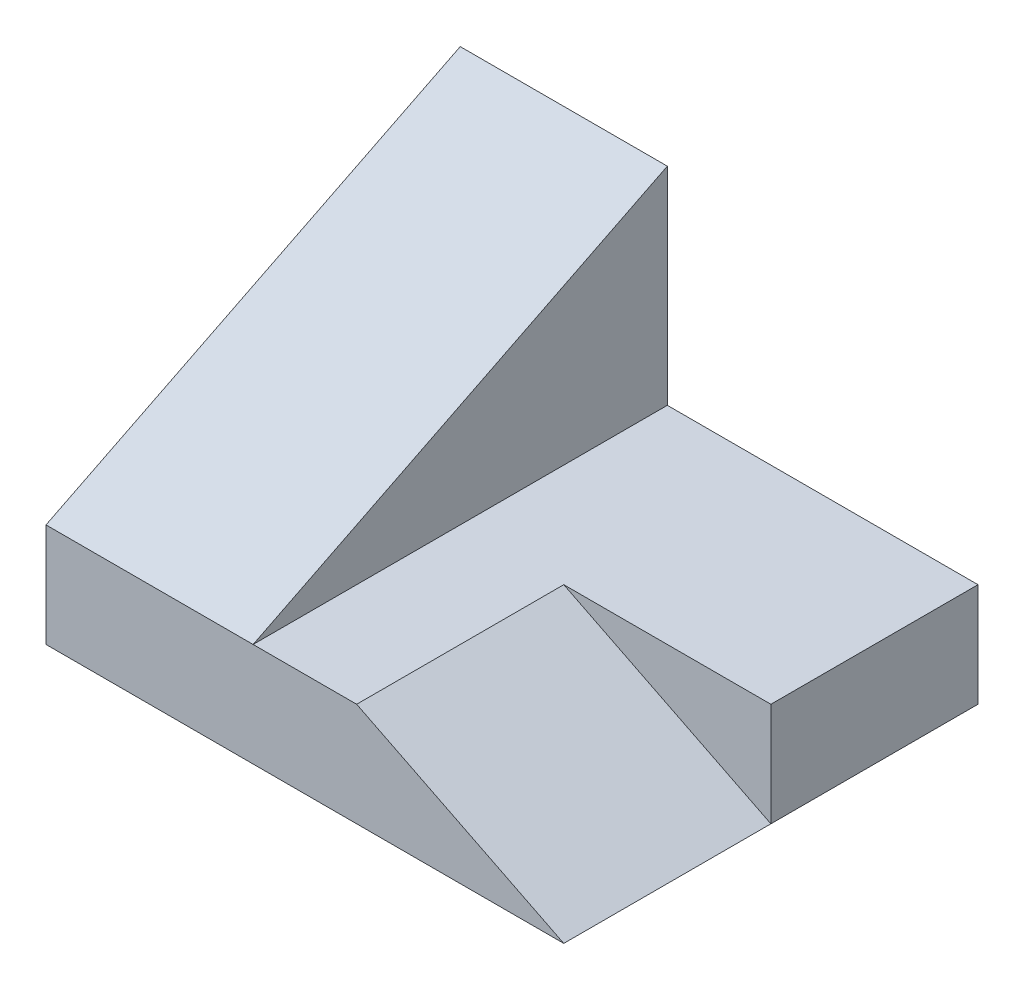
ISO-10303-21;
HEADER;
FILE_DESCRIPTION(('STEP AP214'),'2;1');
FILE_NAME('part.step','',(''),(''),'','','');
FILE_SCHEMA(('AUTOMOTIVE_DESIGN { 1 0 10303 214 1 1 1 1 }'));
ENDSEC;
DATA;
#1=APPLICATION_CONTEXT('core data for automotive mechanical design processes');
#2=APPLICATION_PROTOCOL_DEFINITION('international standard','automotive_design',2000,#1);
#3=PRODUCT_CONTEXT('',#1,'mechanical');
#4=PRODUCT('Part','Part','',(#3));
#5=PRODUCT_RELATED_PRODUCT_CATEGORY('part','',(#4));
#6=PRODUCT_DEFINITION_FORMATION('','',#4);
#7=PRODUCT_DEFINITION_CONTEXT('part definition',#1,'design');
#8=PRODUCT_DEFINITION('design','',#6,#7);
#9=PRODUCT_DEFINITION_SHAPE('','',#8);
#10=(LENGTH_UNIT() NAMED_UNIT(*) SI_UNIT(.MILLI.,.METRE.));
#11=(NAMED_UNIT(*) PLANE_ANGLE_UNIT() SI_UNIT($,.RADIAN.));
#12=(NAMED_UNIT(*) SI_UNIT($,.STERADIAN.) SOLID_ANGLE_UNIT());
#13=UNCERTAINTY_MEASURE_WITH_UNIT(LENGTH_MEASURE(1.E-05),#10,'distance_accuracy_value','');
#14=(GEOMETRIC_REPRESENTATION_CONTEXT(3) GLOBAL_UNCERTAINTY_ASSIGNED_CONTEXT((#13)) GLOBAL_UNIT_ASSIGNED_CONTEXT((#10,
#11,#12)) REPRESENTATION_CONTEXT('',''));
#15=CARTESIAN_POINT('',(0.,0.,0.));
#16=DIRECTION('',(0.,0.,1.));
#17=DIRECTION('',(1.,0.,0.));
#18=AXIS2_PLACEMENT_3D('',#15,#16,#17);
#19=CARTESIAN_POINT('',(63.5,25.4,101.6));
#20=DIRECTION('',(-1.,0.,0.));
#21=DIRECTION('',(0.,0.,1.));
#22=AXIS2_PLACEMENT_3D('',#19,#20,#21);
#23=PLANE('',#22);
#24=DIRECTION('',(0.,1.,0.));
#25=VECTOR('',#24,1.);
#26=CARTESIAN_POINT('',(63.5,0.,50.8));
#27=LINE('',#26,#25);
#28=CARTESIAN_POINT('',(63.5,0.,50.8));
#29=VERTEX_POINT('',#28);
#30=CARTESIAN_POINT('',(63.5,25.4,50.8));
#31=VERTEX_POINT('',#30);
#32=EDGE_CURVE('E96',#29,#31,#27,.T.);
#33=ORIENTED_EDGE('',*,*,#32,.F.);
#34=DIRECTION('',(0.,0.,-1.));
#35=VECTOR('',#34,1.);
#36=CARTESIAN_POINT('',(63.5,0.,101.6));
#37=LINE('',#36,#35);
#38=CARTESIAN_POINT('',(63.5,0.,0.));
#39=VERTEX_POINT('',#38);
#40=EDGE_CURVE('E146',#29,#39,#37,.T.);
#41=ORIENTED_EDGE('',*,*,#40,.T.);
#42=DIRECTION('',(0.,1.,0.));
#43=VECTOR('',#42,1.);
#44=CARTESIAN_POINT('',(63.5,25.4,0.));
#45=LINE('',#44,#43);
#46=CARTESIAN_POINT('',(63.5,25.4,0.));
#47=VERTEX_POINT('',#46);
#48=EDGE_CURVE('E134',#39,#47,#45,.T.);
#49=ORIENTED_EDGE('',*,*,#48,.T.);
#50=DIRECTION('',(0.,0.,-1.));
#51=VECTOR('',#50,1.);
#52=CARTESIAN_POINT('',(63.5,25.4,101.6));
#53=LINE('',#52,#51);
#54=EDGE_CURVE('E145',#31,#47,#53,.T.);
#55=ORIENTED_EDGE('',*,*,#54,.F.);
#56=EDGE_LOOP('',(#33,#41,#49,#55));
#57=FACE_BOUND('',#56,.T.);
#58=ADVANCED_FACE('F33',(#57),#23,.F.);
#59=CARTESIAN_POINT('',(-63.5,0.,101.6));
#60=DIRECTION('',(1.,0.,0.));
#61=DIRECTION('',(0.,1.,0.));
#62=AXIS2_PLACEMENT_3D('',#59,#60,#61);
#63=PLANE('',#62);
#64=DIRECTION('',(0.,-1.,0.));
#65=VECTOR('',#64,1.);
#66=CARTESIAN_POINT('',(-63.5,0.,101.6));
#67=LINE('',#66,#65);
#68=CARTESIAN_POINT('',(-63.5,25.4,101.6));
#69=VERTEX_POINT('',#68);
#70=CARTESIAN_POINT('',(-63.5,0.,101.6));
#71=VERTEX_POINT('',#70);
#72=EDGE_CURVE('E121',#69,#71,#67,.T.);
#73=ORIENTED_EDGE('',*,*,#72,.F.);
#74=DIRECTION('',(0.,0.447213595499958,-0.894427190999916));
#75=VECTOR('',#74,1.);
#76=CARTESIAN_POINT('',(-63.5,20.32,111.76));
#77=LINE('',#76,#75);
#78=CARTESIAN_POINT('',(-63.5,76.2,0.));
#79=VERTEX_POINT('',#78);
#80=EDGE_CURVE('E117',#69,#79,#77,.T.);
#81=ORIENTED_EDGE('',*,*,#80,.T.);
#82=DIRECTION('',(0.,-1.,0.));
#83=VECTOR('',#82,1.);
#84=CARTESIAN_POINT('',(-63.5,0.,0.));
#85=LINE('',#84,#83);
#86=CARTESIAN_POINT('',(-63.5,0.,0.));
#87=VERTEX_POINT('',#86);
#88=EDGE_CURVE('E120',#79,#87,#85,.T.);
#89=ORIENTED_EDGE('',*,*,#88,.T.);
#90=DIRECTION('',(0.,0.,-1.));
#91=VECTOR('',#90,1.);
#92=CARTESIAN_POINT('',(-63.5,0.,101.6));
#93=LINE('',#92,#91);
#94=EDGE_CURVE('E11',#71,#87,#93,.T.);
#95=ORIENTED_EDGE('',*,*,#94,.F.);
#96=EDGE_LOOP('',(#73,#81,#89,#95));
#97=FACE_BOUND('',#96,.T.);
#98=ADVANCED_FACE('F35',(#97),#63,.F.);
#99=CARTESIAN_POINT('',(63.5,0.,101.6));
#100=DIRECTION('',(0.,1.,0.));
#101=DIRECTION('',(0.,0.,1.));
#102=AXIS2_PLACEMENT_3D('',#99,#100,#101);
#103=PLANE('',#102);
#104=DIRECTION('',(1.,0.,0.));
#105=VECTOR('',#104,1.);
#106=CARTESIAN_POINT('',(63.5,0.,0.));
#107=LINE('',#106,#105);
#108=EDGE_CURVE('E131',#87,#39,#107,.T.);
#109=ORIENTED_EDGE('',*,*,#108,.T.);
#110=ORIENTED_EDGE('',*,*,#40,.F.);
#111=CARTESIAN_POINT('',(63.5,0.,101.6));
#112=VERTEX_POINT('',#111);
#113=EDGE_CURVE('E41',#112,#29,#37,.T.);
#114=ORIENTED_EDGE('',*,*,#113,.F.);
#115=DIRECTION('',(1.,0.,0.));
#116=VECTOR('',#115,1.);
#117=CARTESIAN_POINT('',(63.5,0.,101.6));
#118=LINE('',#117,#116);
#119=EDGE_CURVE('E123',#71,#112,#118,.T.);
#120=ORIENTED_EDGE('',*,*,#119,.F.);
#121=ORIENTED_EDGE('',*,*,#94,.T.);
#122=EDGE_LOOP('',(#109,#110,#114,#120,#121));
#123=FACE_BOUND('',#122,.T.);
#124=ADVANCED_FACE('F152',(#123),#103,.F.);
#125=CARTESIAN_POINT('',(-12.7,25.4,101.6));
#126=DIRECTION('',(0.,-1.,0.));
#127=DIRECTION('',(0.,0.,-1.));
#128=AXIS2_PLACEMENT_3D('',#125,#126,#127);
#129=PLANE('',#128);
#130=DIRECTION('',(-1.,0.,0.));
#131=VECTOR('',#130,1.);
#132=CARTESIAN_POINT('',(-12.7,25.4,101.6));
#133=LINE('',#132,#131);
#134=CARTESIAN_POINT('',(12.7,25.4,101.6));
#135=VERTEX_POINT('',#134);
#136=CARTESIAN_POINT('',(-12.7,25.4,101.6));
#137=VERTEX_POINT('',#136);
#138=EDGE_CURVE('E108',#135,#137,#133,.T.);
#139=ORIENTED_EDGE('',*,*,#138,.F.);
#140=DIRECTION('',(0.,0.,1.));
#141=VECTOR('',#140,1.);
#142=CARTESIAN_POINT('',(12.7,25.4,50.8));
#143=LINE('',#142,#141);
#144=CARTESIAN_POINT('',(12.7,25.4,50.8));
#145=VERTEX_POINT('',#144);
#146=EDGE_CURVE('E48',#145,#135,#143,.T.);
#147=ORIENTED_EDGE('',*,*,#146,.F.);
#148=DIRECTION('',(-1.,0.,0.));
#149=VECTOR('',#148,1.);
#150=CARTESIAN_POINT('',(0.,25.4,50.8));
#151=LINE('',#150,#149);
#152=EDGE_CURVE('E97',#31,#145,#151,.T.);
#153=ORIENTED_EDGE('',*,*,#152,.F.);
#154=ORIENTED_EDGE('',*,*,#54,.T.);
#155=DIRECTION('',(-1.,0.,0.));
#156=VECTOR('',#155,1.);
#157=CARTESIAN_POINT('',(-12.7,25.4,0.));
#158=LINE('',#157,#156);
#159=CARTESIAN_POINT('',(-12.7,25.4,0.));
#160=VERTEX_POINT('',#159);
#161=EDGE_CURVE('E137',#47,#160,#158,.T.);
#162=ORIENTED_EDGE('',*,*,#161,.T.);
#163=DIRECTION('',(0.,0.,-1.));
#164=VECTOR('',#163,1.);
#165=CARTESIAN_POINT('',(-12.7,25.4,101.6));
#166=LINE('',#165,#164);
#167=EDGE_CURVE('E128',#137,#160,#166,.T.);
#168=ORIENTED_EDGE('',*,*,#167,.F.);
#169=EDGE_LOOP('',(#139,#147,#153,#154,#162,#168));
#170=FACE_BOUND('',#169,.T.);
#171=ADVANCED_FACE('F106',(#170),#129,.F.);
#172=CARTESIAN_POINT('',(-12.7,76.2,101.6));
#173=DIRECTION('',(-1.,0.,0.));
#174=DIRECTION('',(0.,-1.,0.));
#175=AXIS2_PLACEMENT_3D('',#172,#173,#174);
#176=PLANE('',#175);
#177=DIRECTION('',(0.,1.,0.));
#178=VECTOR('',#177,1.);
#179=CARTESIAN_POINT('',(-12.7,76.2,0.));
#180=LINE('',#179,#178);
#181=CARTESIAN_POINT('',(-12.7,76.2,0.));
#182=VERTEX_POINT('',#181);
#183=EDGE_CURVE('E139',#160,#182,#180,.T.);
#184=ORIENTED_EDGE('',*,*,#183,.T.);
#185=DIRECTION('',(0.,-0.447213595499958,0.894427190999916));
#186=VECTOR('',#185,1.);
#187=CARTESIAN_POINT('',(-12.7,35.56,81.28));
#188=LINE('',#187,#186);
#189=EDGE_CURVE('E110',#182,#137,#188,.T.);
#190=ORIENTED_EDGE('',*,*,#189,.T.);
#191=ORIENTED_EDGE('',*,*,#167,.T.);
#192=EDGE_LOOP('',(#184,#190,#191));
#193=FACE_BOUND('',#192,.T.);
#194=ADVANCED_FACE('F160',(#193),#176,.F.);
#195=CARTESIAN_POINT('',(0.,0.,101.6));
#196=DIRECTION('',(0.,0.,-1.));
#197=DIRECTION('',(-1.,0.,0.));
#198=AXIS2_PLACEMENT_3D('',#195,#196,#197);
#199=PLANE('',#198);
#200=ORIENTED_EDGE('',*,*,#119,.T.);
#201=DIRECTION('',(0.894427190999916,-0.447213595499958,0.));
#202=VECTOR('',#201,1.);
#203=CARTESIAN_POINT('',(12.7,25.4,101.6));
#204=LINE('',#203,#202);
#205=EDGE_CURVE('E103',#135,#112,#204,.T.);
#206=ORIENTED_EDGE('',*,*,#205,.F.);
#207=ORIENTED_EDGE('',*,*,#138,.T.);
#208=DIRECTION('',(-1.,0.,0.));
#209=VECTOR('',#208,1.);
#210=CARTESIAN_POINT('',(275.306403026729,25.4000000000001,101.6));
#211=LINE('',#210,#209);
#212=EDGE_CURVE('E56',#137,#69,#211,.T.);
#213=ORIENTED_EDGE('',*,*,#212,.T.);
#214=ORIENTED_EDGE('',*,*,#72,.T.);
#215=EDGE_LOOP('',(#200,#206,#207,#213,#214));
#216=FACE_BOUND('',#215,.T.);
#217=ADVANCED_FACE('F166',(#216),#199,.F.);
#218=CARTESIAN_POINT('',(0.,0.,0.));
#219=DIRECTION('',(0.,0.,-1.));
#220=DIRECTION('',(-1.,0.,0.));
#221=AXIS2_PLACEMENT_3D('',#218,#219,#220);
#222=PLANE('',#221);
#223=ORIENTED_EDGE('',*,*,#88,.F.);
#224=DIRECTION('',(-1.,0.,0.));
#225=VECTOR('',#224,1.);
#226=CARTESIAN_POINT('',(-63.5,76.2,0.));
#227=LINE('',#226,#225);
#228=EDGE_CURVE('E124',#182,#79,#227,.T.);
#229=ORIENTED_EDGE('',*,*,#228,.F.);
#230=ORIENTED_EDGE('',*,*,#183,.F.);
#231=ORIENTED_EDGE('',*,*,#161,.F.);
#232=ORIENTED_EDGE('',*,*,#48,.F.);
#233=ORIENTED_EDGE('',*,*,#108,.F.);
#234=EDGE_LOOP('',(#223,#229,#230,#231,#232,#233));
#235=FACE_BOUND('',#234,.T.);
#236=ADVANCED_FACE('F156',(#235),#222,.T.);
#237=CARTESIAN_POINT('',(275.306403026729,76.2000000000001,0.));
#238=DIRECTION('',(0.,-0.894427190999916,-0.447213595499958));
#239=DIRECTION('',(0.,0.447213595499958,-0.894427190999916));
#240=AXIS2_PLACEMENT_3D('',#237,#238,#239);
#241=PLANE('',#240);
#242=ORIENTED_EDGE('',*,*,#80,.F.);
#243=ORIENTED_EDGE('',*,*,#212,.F.);
#244=ORIENTED_EDGE('',*,*,#189,.F.);
#245=ORIENTED_EDGE('',*,*,#228,.T.);
#246=EDGE_LOOP('',(#242,#243,#244,#245));
#247=FACE_BOUND('',#246,.T.);
#248=ADVANCED_FACE('F164',(#247),#241,.F.);
#249=CARTESIAN_POINT('',(12.7,25.4,50.8));
#250=DIRECTION('',(-0.447213595499958,-0.894427190999916,0.));
#251=DIRECTION('',(0.894427190999916,-0.447213595499958,0.));
#252=AXIS2_PLACEMENT_3D('',#249,#250,#251);
#253=PLANE('',#252);
#254=ORIENTED_EDGE('',*,*,#205,.T.);
#255=ORIENTED_EDGE('',*,*,#113,.T.);
#256=DIRECTION('',(0.894427190999916,-0.447213595499958,0.));
#257=VECTOR('',#256,1.);
#258=CARTESIAN_POINT('',(12.7,25.4,50.8));
#259=LINE('',#258,#257);
#260=EDGE_CURVE('E90',#145,#29,#259,.T.);
#261=ORIENTED_EDGE('',*,*,#260,.F.);
#262=ORIENTED_EDGE('',*,*,#146,.T.);
#263=EDGE_LOOP('',(#254,#255,#261,#262));
#264=FACE_BOUND('',#263,.T.);
#265=ADVANCED_FACE('F92',(#264),#253,.F.);
#266=CARTESIAN_POINT('',(0.,0.,50.8));
#267=DIRECTION('',(0.,0.,1.));
#268=DIRECTION('',(1.,0.,0.));
#269=AXIS2_PLACEMENT_3D('',#266,#267,#268);
#270=PLANE('',#269);
#271=ORIENTED_EDGE('',*,*,#152,.T.);
#272=ORIENTED_EDGE('',*,*,#260,.T.);
#273=ORIENTED_EDGE('',*,*,#32,.T.);
#274=EDGE_LOOP('',(#271,#272,#273));
#275=FACE_BOUND('',#274,.T.);
#276=ADVANCED_FACE('F100',(#275),#270,.T.);
#277=CLOSED_SHELL('',(#58,#98,#124,#171,#194,#217,#236,#248,#265,#276));
#278=MANIFOLD_SOLID_BREP('B2',#277);
#279=ADVANCED_BREP_SHAPE_REPRESENTATION('',(#18,#278),#14);
#280=SHAPE_DEFINITION_REPRESENTATION(#9,#279);
ENDSEC;
END-ISO-10303-21;
